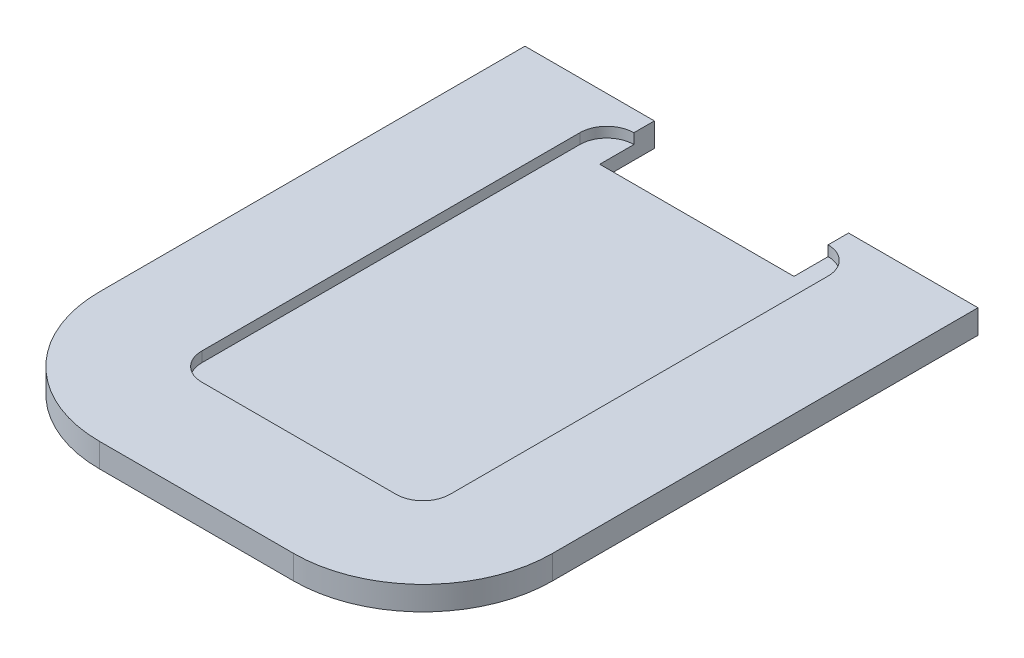
ISO-10303-21;
HEADER;
FILE_DESCRIPTION(('STEP AP214'),'2;1');
FILE_NAME('part.step','',(''),(''),'','','');
FILE_SCHEMA(('AUTOMOTIVE_DESIGN { 1 0 10303 214 1 1 1 1 }'));
ENDSEC;
DATA;
#1=APPLICATION_CONTEXT('core data for automotive mechanical design processes');
#2=APPLICATION_PROTOCOL_DEFINITION('international standard','automotive_design',2000,#1);
#3=PRODUCT_CONTEXT('',#1,'mechanical');
#4=PRODUCT('Part','Part','',(#3));
#5=PRODUCT_RELATED_PRODUCT_CATEGORY('part','',(#4));
#6=PRODUCT_DEFINITION_FORMATION('','',#4);
#7=PRODUCT_DEFINITION_CONTEXT('part definition',#1,'design');
#8=PRODUCT_DEFINITION('design','',#6,#7);
#9=PRODUCT_DEFINITION_SHAPE('','',#8);
#10=(LENGTH_UNIT() NAMED_UNIT(*) SI_UNIT(.MILLI.,.METRE.));
#11=(NAMED_UNIT(*) PLANE_ANGLE_UNIT() SI_UNIT($,.RADIAN.));
#12=(NAMED_UNIT(*) SI_UNIT($,.STERADIAN.) SOLID_ANGLE_UNIT());
#13=UNCERTAINTY_MEASURE_WITH_UNIT(LENGTH_MEASURE(1.E-05),#10,'distance_accuracy_value','');
#14=(GEOMETRIC_REPRESENTATION_CONTEXT(3) GLOBAL_UNCERTAINTY_ASSIGNED_CONTEXT((#13)) GLOBAL_UNIT_ASSIGNED_CONTEXT((#10,
#11,#12)) REPRESENTATION_CONTEXT('',''));
#15=CARTESIAN_POINT('',(0.,0.,0.));
#16=DIRECTION('',(0.,0.,1.));
#17=DIRECTION('',(1.,0.,0.));
#18=AXIS2_PLACEMENT_3D('',#15,#16,#17);
#19=CARTESIAN_POINT('',(14.2680130522602,28.4273462857754,2.97171263536325E-13));
#20=DIRECTION('',(-1.,0.,0.));
#21=DIRECTION('',(0.,0.,1.));
#22=AXIS2_PLACEMENT_3D('',#19,#20,#21);
#23=PLANE('',#22);
#24=DIRECTION('',(0.,0.,1.));
#25=VECTOR('',#24,1.);
#26=CARTESIAN_POINT('',(14.2680130522602,30.4273462857754,3.18120151569384E-13));
#27=LINE('',#26,#25);
#28=CARTESIAN_POINT('',(14.2680130522602,30.4273462857752,15.1963205655378));
#29=VERTEX_POINT('',#28);
#30=CARTESIAN_POINT('',(14.2680130522602,30.4273462857752,20.1963205655378));
#31=VERTEX_POINT('',#30);
#32=EDGE_CURVE('E128',#29,#31,#27,.T.);
#33=ORIENTED_EDGE('',*,*,#32,.T.);
#34=DIRECTION('',(0.,1.,0.));
#35=VECTOR('',#34,1.);
#36=CARTESIAN_POINT('',(14.2680130522602,28.4273462857752,20.1963205655378));
#37=LINE('',#36,#35);
#38=CARTESIAN_POINT('',(14.2680130522602,28.4273462857752,20.1963205655378));
#39=VERTEX_POINT('',#38);
#40=EDGE_CURVE('E11',#39,#31,#37,.T.);
#41=ORIENTED_EDGE('',*,*,#40,.F.);
#42=DIRECTION('',(0.,0.,1.));
#43=VECTOR('',#42,1.);
#44=CARTESIAN_POINT('',(14.2680130522602,28.4273462857754,2.97171263536325E-13));
#45=LINE('',#44,#43);
#46=CARTESIAN_POINT('',(14.2680130522602,28.4273462857753,12.1963205655378));
#47=VERTEX_POINT('',#46);
#48=EDGE_CURVE('E137',#47,#39,#45,.T.);
#49=ORIENTED_EDGE('',*,*,#48,.F.);
#50=DIRECTION('',(0.,-1.,0.));
#51=VECTOR('',#50,1.);
#52=CARTESIAN_POINT('',(14.2680130522602,31.9273462857753,12.1963205655378));
#53=LINE('',#52,#51);
#54=CARTESIAN_POINT('',(14.2680130522602,31.9273462857753,12.1963205655378));
#55=VERTEX_POINT('',#54);
#56=EDGE_CURVE('E168',#55,#47,#53,.T.);
#57=ORIENTED_EDGE('',*,*,#56,.F.);
#58=DIRECTION('',(0.,0.,1.));
#59=VECTOR('',#58,1.);
#60=CARTESIAN_POINT('',(14.2680130522602,31.9273462857753,15.1963205655378));
#61=LINE('',#60,#59);
#62=CARTESIAN_POINT('',(14.2680130522602,31.9273462857753,15.1963205655378));
#63=VERTEX_POINT('',#62);
#64=EDGE_CURVE('E233',#55,#63,#61,.T.);
#65=ORIENTED_EDGE('',*,*,#64,.T.);
#66=DIRECTION('',(0.,-1.,0.));
#67=VECTOR('',#66,1.);
#68=CARTESIAN_POINT('',(14.2680130522602,31.9273462857753,15.1963205655378));
#69=LINE('',#68,#67);
#70=EDGE_CURVE('E162',#63,#29,#69,.T.);
#71=ORIENTED_EDGE('',*,*,#70,.T.);
#72=EDGE_LOOP('',(#33,#41,#49,#57,#65,#71));
#73=FACE_BOUND('',#72,.T.);
#74=ADVANCED_FACE('F37',(#73),#23,.F.);
#75=CARTESIAN_POINT('',(0.,28.4273462857752,20.1963205655378));
#76=DIRECTION('',(0.,0.,1.));
#77=DIRECTION('',(0.,-1.,0.));
#78=AXIS2_PLACEMENT_3D('',#75,#76,#77);
#79=PLANE('',#78);
#80=DIRECTION('',(1.,0.,0.));
#81=VECTOR('',#80,1.);
#82=CARTESIAN_POINT('',(0.,30.4273462857752,20.1963205655378));
#83=LINE('',#82,#81);
#84=CARTESIAN_POINT('',(42.7160130522602,30.4273462857752,20.1963205655378));
#85=VERTEX_POINT('',#84);
#86=EDGE_CURVE('E131',#31,#85,#83,.T.);
#87=ORIENTED_EDGE('',*,*,#86,.T.);
#88=DIRECTION('',(0.,1.,0.));
#89=VECTOR('',#88,1.);
#90=CARTESIAN_POINT('',(42.7160130522602,28.4273462857752,20.1963205655378));
#91=LINE('',#90,#89);
#92=CARTESIAN_POINT('',(42.7160130522602,28.4273462857752,20.1963205655378));
#93=VERTEX_POINT('',#92);
#94=EDGE_CURVE('E44',#93,#85,#91,.T.);
#95=ORIENTED_EDGE('',*,*,#94,.F.);
#96=DIRECTION('',(1.,0.,0.));
#97=VECTOR('',#96,1.);
#98=CARTESIAN_POINT('',(0.,28.4273462857752,20.1963205655378));
#99=LINE('',#98,#97);
#100=EDGE_CURVE('E82',#39,#93,#99,.T.);
#101=ORIENTED_EDGE('',*,*,#100,.F.);
#102=ORIENTED_EDGE('',*,*,#40,.T.);
#103=EDGE_LOOP('',(#87,#95,#101,#102));
#104=FACE_BOUND('',#103,.T.);
#105=ADVANCED_FACE('F359',(#104),#79,.F.);
#106=CARTESIAN_POINT('',(42.7160130522602,28.4273462857754,3.56451640049835E-13));
#107=DIRECTION('',(-1.,0.,0.));
#108=DIRECTION('',(0.,0.,1.));
#109=AXIS2_PLACEMENT_3D('',#106,#107,#108);
#110=PLANE('',#109);
#111=DIRECTION('',(0.,0.,1.));
#112=VECTOR('',#111,1.);
#113=CARTESIAN_POINT('',(42.7160130522602,30.4273462857754,3.77400528082894E-13));
#114=LINE('',#113,#112);
#115=CARTESIAN_POINT('',(42.7160130522602,30.4273462857752,15.1963205655378));
#116=VERTEX_POINT('',#115);
#117=EDGE_CURVE('E134',#116,#85,#114,.T.);
#118=ORIENTED_EDGE('',*,*,#117,.F.);
#119=DIRECTION('',(0.,-1.,0.));
#120=VECTOR('',#119,1.);
#121=CARTESIAN_POINT('',(42.7160130522602,31.9273462857753,15.1963205655378));
#122=LINE('',#121,#120);
#123=CARTESIAN_POINT('',(42.7160130522602,31.9273462857753,15.1963205655378));
#124=VERTEX_POINT('',#123);
#125=EDGE_CURVE('E160',#124,#116,#122,.T.);
#126=ORIENTED_EDGE('',*,*,#125,.F.);
#127=DIRECTION('',(0.,0.,-1.));
#128=VECTOR('',#127,1.);
#129=CARTESIAN_POINT('',(42.7160130522602,31.9273462857753,15.1963205655378));
#130=LINE('',#129,#128);
#131=CARTESIAN_POINT('',(42.7160130522602,31.9273462857753,12.1963205655378));
#132=VERTEX_POINT('',#131);
#133=EDGE_CURVE('E223',#124,#132,#130,.T.);
#134=ORIENTED_EDGE('',*,*,#133,.T.);
#135=DIRECTION('',(0.,-1.,0.));
#136=VECTOR('',#135,1.);
#137=CARTESIAN_POINT('',(42.7160130522602,31.9273462857753,12.1963205655378));
#138=LINE('',#137,#136);
#139=CARTESIAN_POINT('',(42.7160130522602,28.4273462857753,12.1963205655378));
#140=VERTEX_POINT('',#139);
#141=EDGE_CURVE('E219',#132,#140,#138,.T.);
#142=ORIENTED_EDGE('',*,*,#141,.T.);
#143=DIRECTION('',(0.,0.,1.));
#144=VECTOR('',#143,1.);
#145=CARTESIAN_POINT('',(42.7160130522602,28.4273462857754,3.56451640049835E-13));
#146=LINE('',#145,#144);
#147=EDGE_CURVE('E207',#140,#93,#146,.T.);
#148=ORIENTED_EDGE('',*,*,#147,.T.);
#149=ORIENTED_EDGE('',*,*,#94,.T.);
#150=EDGE_LOOP('',(#118,#126,#134,#142,#148,#149));
#151=FACE_BOUND('',#150,.T.);
#152=ADVANCED_FACE('F347',(#151),#110,.T.);
#153=CARTESIAN_POINT('',(61.6760130522602,28.4273462857754,2.97171263536325E-13));
#154=DIRECTION('',(1.,0.,0.));
#155=DIRECTION('',(0.,0.,-1.));
#156=AXIS2_PLACEMENT_3D('',#153,#154,#155);
#157=PLANE('',#156);
#158=DIRECTION('',(0.,0.,-1.));
#159=VECTOR('',#158,1.);
#160=CARTESIAN_POINT('',(61.6760130522602,28.4273462857754,2.97171263536325E-13));
#161=LINE('',#160,#159);
#162=CARTESIAN_POINT('',(61.6760130522602,28.4273462857746,74.5283205655378));
#163=VERTEX_POINT('',#162);
#164=CARTESIAN_POINT('',(61.6760130522602,28.4273462857753,12.1963205655378));
#165=VERTEX_POINT('',#164);
#166=EDGE_CURVE('E102',#163,#165,#161,.T.);
#167=ORIENTED_EDGE('',*,*,#166,.T.);
#168=DIRECTION('',(0.,-1.,0.));
#169=VECTOR('',#168,1.);
#170=CARTESIAN_POINT('',(61.6760130522602,31.9273462857753,12.1963205655378));
#171=LINE('',#170,#169);
#172=CARTESIAN_POINT('',(61.6760130522602,31.9273462857753,12.1963205655378));
#173=VERTEX_POINT('',#172);
#174=EDGE_CURVE('E158',#173,#165,#171,.T.);
#175=ORIENTED_EDGE('',*,*,#174,.F.);
#176=DIRECTION('',(0.,0.,-1.));
#177=VECTOR('',#176,1.);
#178=CARTESIAN_POINT('',(61.6760130522602,31.9273462857754,3.33802762299626E-13));
#179=LINE('',#178,#177);
#180=CARTESIAN_POINT('',(61.6760130522602,31.9273462857746,74.5283205655379));
#181=VERTEX_POINT('',#180);
#182=EDGE_CURVE('E151',#181,#173,#179,.T.);
#183=ORIENTED_EDGE('',*,*,#182,.F.);
#184=DIRECTION('',(0.,1.,0.));
#185=VECTOR('',#184,1.);
#186=CARTESIAN_POINT('',(61.6760130522602,28.4273462857746,74.5283205655378));
#187=LINE('',#186,#185);
#188=EDGE_CURVE('E116',#163,#181,#187,.T.);
#189=ORIENTED_EDGE('',*,*,#188,.F.);
#190=EDGE_LOOP('',(#167,#175,#183,#189));
#191=FACE_BOUND('',#190,.T.);
#192=ADVANCED_FACE('F156',(#191),#157,.T.);
#193=CARTESIAN_POINT('',(42.7160130522602,28.4273462857746,74.5283205655378));
#194=DIRECTION('',(0.,1.,0.));
#195=DIRECTION('',(0.,0.,1.));
#196=AXIS2_PLACEMENT_3D('',#193,#194,#195);
#197=CYLINDRICAL_SURFACE('',#196,18.96);
#198=ORIENTED_EDGE('',*,*,#188,.T.);
#199=CARTESIAN_POINT('',(42.7160130522602,31.9273462857746,74.5283205655379));
#200=DIRECTION('',(0.,1.,0.));
#201=DIRECTION('',(0.,0.,1.));
#202=AXIS2_PLACEMENT_3D('',#199,#200,#201);
#203=CIRCLE('',#202,18.96);
#204=CARTESIAN_POINT('',(42.7160130522602,31.9273462857744,93.4883205655378));
#205=VERTEX_POINT('',#204);
#206=EDGE_CURVE('E112',#205,#181,#203,.T.);
#207=ORIENTED_EDGE('',*,*,#206,.F.);
#208=DIRECTION('',(0.,1.,0.));
#209=VECTOR('',#208,1.);
#210=CARTESIAN_POINT('',(42.7160130522602,28.4273462857744,93.4883205655378));
#211=LINE('',#210,#209);
#212=CARTESIAN_POINT('',(42.7160130522602,28.4273462857744,93.4883205655378));
#213=VERTEX_POINT('',#212);
#214=EDGE_CURVE('E108',#213,#205,#211,.T.);
#215=ORIENTED_EDGE('',*,*,#214,.F.);
#216=CARTESIAN_POINT('',(42.7160130522602,28.4273462857746,74.5283205655378));
#217=DIRECTION('',(0.,-1.,0.));
#218=DIRECTION('',(0.,0.,-1.));
#219=AXIS2_PLACEMENT_3D('',#216,#217,#218);
#220=CIRCLE('',#219,18.96);
#221=EDGE_CURVE('E94',#163,#213,#220,.T.);
#222=ORIENTED_EDGE('',*,*,#221,.F.);
#223=EDGE_LOOP('',(#198,#207,#215,#222));
#224=FACE_BOUND('',#223,.T.);
#225=ADVANCED_FACE('F109',(#224),#197,.T.);
#226=CARTESIAN_POINT('',(0.,28.4273462857744,93.4883205655378));
#227=DIRECTION('',(0.,0.,-1.));
#228=DIRECTION('',(0.,1.,0.));
#229=AXIS2_PLACEMENT_3D('',#226,#227,#228);
#230=PLANE('',#229);
#231=ORIENTED_EDGE('',*,*,#214,.T.);
#232=DIRECTION('',(1.,0.,0.));
#233=VECTOR('',#232,1.);
#234=CARTESIAN_POINT('',(0.,31.9273462857744,93.4883205655378));
#235=LINE('',#234,#233);
#236=CARTESIAN_POINT('',(14.2680130522602,31.9273462857744,93.4883205655378));
#237=VERTEX_POINT('',#236);
#238=EDGE_CURVE('E154',#237,#205,#235,.T.);
#239=ORIENTED_EDGE('',*,*,#238,.F.);
#240=DIRECTION('',(0.,1.,0.));
#241=VECTOR('',#240,1.);
#242=CARTESIAN_POINT('',(14.2680130522602,28.4273462857744,93.4883205655378));
#243=LINE('',#242,#241);
#244=CARTESIAN_POINT('',(14.2680130522602,28.4273462857744,93.4883205655378));
#245=VERTEX_POINT('',#244);
#246=EDGE_CURVE('E117',#245,#237,#243,.T.);
#247=ORIENTED_EDGE('',*,*,#246,.F.);
#248=DIRECTION('',(-1.,0.,0.));
#249=VECTOR('',#248,1.);
#250=CARTESIAN_POINT('',(0.,28.4273462857744,93.4883205655378));
#251=LINE('',#250,#249);
#252=EDGE_CURVE('E98',#213,#245,#251,.T.);
#253=ORIENTED_EDGE('',*,*,#252,.F.);
#254=EDGE_LOOP('',(#231,#239,#247,#253));
#255=FACE_BOUND('',#254,.T.);
#256=ADVANCED_FACE('F119',(#255),#230,.F.);
#257=CARTESIAN_POINT('',(14.2680130522602,28.4273462857746,74.5283205655378));
#258=DIRECTION('',(0.,1.,0.));
#259=DIRECTION('',(0.,0.,1.));
#260=AXIS2_PLACEMENT_3D('',#257,#258,#259);
#261=CYLINDRICAL_SURFACE('',#260,18.96);
#262=ORIENTED_EDGE('',*,*,#246,.T.);
#263=CARTESIAN_POINT('',(14.2680130522602,31.9273462857746,74.5283205655379));
#264=DIRECTION('',(0.,1.,0.));
#265=DIRECTION('',(0.,0.,1.));
#266=AXIS2_PLACEMENT_3D('',#263,#264,#265);
#267=CIRCLE('',#266,18.96);
#268=CARTESIAN_POINT('',(-4.6919869477398,31.9273462857746,74.5283205655379));
#269=VERTEX_POINT('',#268);
#270=EDGE_CURVE('E266',#269,#237,#267,.T.);
#271=ORIENTED_EDGE('',*,*,#270,.F.);
#272=DIRECTION('',(0.,1.,0.));
#273=VECTOR('',#272,1.);
#274=CARTESIAN_POINT('',(-4.6919869477398,28.4273462857746,74.5283205655378));
#275=LINE('',#274,#273);
#276=CARTESIAN_POINT('',(-4.6919869477398,28.4273462857746,74.5283205655378));
#277=VERTEX_POINT('',#276);
#278=EDGE_CURVE('E127',#277,#269,#275,.T.);
#279=ORIENTED_EDGE('',*,*,#278,.F.);
#280=CARTESIAN_POINT('',(14.2680130522602,28.4273462857746,74.5283205655378));
#281=DIRECTION('',(0.,-1.,0.));
#282=DIRECTION('',(0.,0.,-1.));
#283=AXIS2_PLACEMENT_3D('',#280,#281,#282);
#284=CIRCLE('',#283,18.96);
#285=EDGE_CURVE('E60',#245,#277,#284,.T.);
#286=ORIENTED_EDGE('',*,*,#285,.F.);
#287=EDGE_LOOP('',(#262,#271,#279,#286));
#288=FACE_BOUND('',#287,.T.);
#289=ADVANCED_FACE('F274',(#288),#261,.T.);
#290=CARTESIAN_POINT('',(-4.69198694773981,28.4273462857754,2.97465249663148E-13));
#291=DIRECTION('',(1.,0.,0.));
#292=DIRECTION('',(0.,0.,-1.));
#293=AXIS2_PLACEMENT_3D('',#290,#291,#292);
#294=PLANE('',#293);
#295=ORIENTED_EDGE('',*,*,#278,.T.);
#296=DIRECTION('',(0.,0.,1.));
#297=VECTOR('',#296,1.);
#298=CARTESIAN_POINT('',(-4.69198694773981,31.9273462857754,3.34096748426449E-13));
#299=LINE('',#298,#297);
#300=CARTESIAN_POINT('',(-4.69198694773981,31.9273462857753,12.1963205655378));
#301=VERTEX_POINT('',#300);
#302=EDGE_CURVE('E263',#301,#269,#299,.T.);
#303=ORIENTED_EDGE('',*,*,#302,.F.);
#304=DIRECTION('',(0.,-1.,0.));
#305=VECTOR('',#304,1.);
#306=CARTESIAN_POINT('',(-4.69198694773981,31.9273462857753,12.1963205655378));
#307=LINE('',#306,#305);
#308=CARTESIAN_POINT('',(-4.69198694773981,28.4273462857753,12.1963205655378));
#309=VERTEX_POINT('',#308);
#310=EDGE_CURVE('E236',#301,#309,#307,.T.);
#311=ORIENTED_EDGE('',*,*,#310,.T.);
#312=DIRECTION('',(0.,0.,-1.));
#313=VECTOR('',#312,1.);
#314=CARTESIAN_POINT('',(-4.69198694773981,28.4273462857754,2.97465249663148E-13));
#315=LINE('',#314,#313);
#316=EDGE_CURVE('E122',#277,#309,#315,.T.);
#317=ORIENTED_EDGE('',*,*,#316,.F.);
#318=EDGE_LOOP('',(#295,#303,#311,#317));
#319=FACE_BOUND('',#318,.T.);
#320=ADVANCED_FACE('F377',(#319),#294,.F.);
#321=CARTESIAN_POINT('',(0.,28.4273462857754,2.97171263536325E-13));
#322=DIRECTION('',(0.,-1.,0.));
#323=DIRECTION('',(0.,0.,-1.));
#324=AXIS2_PLACEMENT_3D('',#321,#322,#323);
#325=PLANE('',#324);
#326=ORIENTED_EDGE('',*,*,#48,.T.);
#327=ORIENTED_EDGE('',*,*,#100,.T.);
#328=ORIENTED_EDGE('',*,*,#147,.F.);
#329=DIRECTION('',(1.,0.,0.));
#330=VECTOR('',#329,1.);
#331=CARTESIAN_POINT('',(42.7160130522602,28.4273462857753,12.1963205655378));
#332=LINE('',#331,#330);
#333=EDGE_CURVE('E216',#140,#165,#332,.T.);
#334=ORIENTED_EDGE('',*,*,#333,.T.);
#335=ORIENTED_EDGE('',*,*,#166,.F.);
#336=ORIENTED_EDGE('',*,*,#221,.T.);
#337=ORIENTED_EDGE('',*,*,#252,.T.);
#338=ORIENTED_EDGE('',*,*,#285,.T.);
#339=ORIENTED_EDGE('',*,*,#316,.T.);
#340=DIRECTION('',(1.,0.,0.));
#341=VECTOR('',#340,1.);
#342=CARTESIAN_POINT('',(-4.69198694773981,28.4273462857753,12.1963205655378));
#343=LINE('',#342,#341);
#344=EDGE_CURVE('E218',#309,#47,#343,.T.);
#345=ORIENTED_EDGE('',*,*,#344,.T.);
#346=EDGE_LOOP('',(#326,#327,#328,#334,#335,#336,#337,#338,#339,#345));
#347=FACE_BOUND('',#346,.T.);
#348=ADVANCED_FACE('F96',(#347),#325,.T.);
#349=CARTESIAN_POINT('',(0.,30.4273462857754,3.18120151569384E-13));
#350=DIRECTION('',(0.,-1.,0.));
#351=DIRECTION('',(0.,0.,-1.));
#352=AXIS2_PLACEMENT_3D('',#349,#350,#351);
#353=PLANE('',#352);
#354=DIRECTION('',(0.,0.,-1.));
#355=VECTOR('',#354,1.);
#356=CARTESIAN_POINT('',(46.6760130522602,30.4273462857754,3.18120151569384E-13));
#357=LINE('',#356,#355);
#358=CARTESIAN_POINT('',(46.6760130522602,30.4273462857746,74.5283205655378));
#359=VERTEX_POINT('',#358);
#360=CARTESIAN_POINT('',(46.6760130522602,30.4273462857752,19.1563205655378));
#361=VERTEX_POINT('',#360);
#362=EDGE_CURVE('E167',#359,#361,#357,.T.);
#363=ORIENTED_EDGE('',*,*,#362,.T.);
#364=CARTESIAN_POINT('',(42.7160130522602,30.4273462857752,19.1563205655378));
#365=DIRECTION('',(0.,1.,0.));
#366=DIRECTION('',(0.,0.,1.));
#367=AXIS2_PLACEMENT_3D('',#364,#365,#366);
#368=CIRCLE('',#367,3.96);
#369=EDGE_CURVE('E51',#361,#116,#368,.T.);
#370=ORIENTED_EDGE('',*,*,#369,.T.);
#371=ORIENTED_EDGE('',*,*,#117,.T.);
#372=ORIENTED_EDGE('',*,*,#86,.F.);
#373=ORIENTED_EDGE('',*,*,#32,.F.);
#374=CARTESIAN_POINT('',(14.2680130522602,30.4273462857752,19.1563205655378));
#375=DIRECTION('',(0.,1.,0.));
#376=DIRECTION('',(0.,0.,1.));
#377=AXIS2_PLACEMENT_3D('',#374,#375,#376);
#378=CIRCLE('',#377,3.96);
#379=CARTESIAN_POINT('',(10.3080130522602,30.4273462857752,19.1563205655378));
#380=VERTEX_POINT('',#379);
#381=EDGE_CURVE('E183',#29,#380,#378,.T.);
#382=ORIENTED_EDGE('',*,*,#381,.T.);
#383=DIRECTION('',(0.,0.,1.));
#384=VECTOR('',#383,1.);
#385=CARTESIAN_POINT('',(10.3080130522602,30.4273462857754,3.18120151569384E-13));
#386=LINE('',#385,#384);
#387=CARTESIAN_POINT('',(10.3080130522602,30.4273462857746,74.5283205655378));
#388=VERTEX_POINT('',#387);
#389=EDGE_CURVE('E180',#380,#388,#386,.T.);
#390=ORIENTED_EDGE('',*,*,#389,.T.);
#391=CARTESIAN_POINT('',(14.2680130522602,30.4273462857746,74.5283205655378));
#392=DIRECTION('',(0.,1.,0.));
#393=DIRECTION('',(0.,0.,1.));
#394=AXIS2_PLACEMENT_3D('',#391,#392,#393);
#395=CIRCLE('',#394,3.96);
#396=CARTESIAN_POINT('',(14.2680130522602,30.4273462857746,78.4883205655378));
#397=VERTEX_POINT('',#396);
#398=EDGE_CURVE('E177',#388,#397,#395,.T.);
#399=ORIENTED_EDGE('',*,*,#398,.T.);
#400=DIRECTION('',(1.,0.,0.));
#401=VECTOR('',#400,1.);
#402=CARTESIAN_POINT('',(0.,30.4273462857746,78.4883205655378));
#403=LINE('',#402,#401);
#404=CARTESIAN_POINT('',(42.7160130522602,30.4273462857746,78.4883205655378));
#405=VERTEX_POINT('',#404);
#406=EDGE_CURVE('E174',#397,#405,#403,.T.);
#407=ORIENTED_EDGE('',*,*,#406,.T.);
#408=CARTESIAN_POINT('',(42.7160130522602,30.4273462857746,74.5283205655378));
#409=DIRECTION('',(0.,1.,0.));
#410=DIRECTION('',(0.,0.,1.));
#411=AXIS2_PLACEMENT_3D('',#408,#409,#410);
#412=CIRCLE('',#411,3.95999999999999);
#413=EDGE_CURVE('E171',#405,#359,#412,.T.);
#414=ORIENTED_EDGE('',*,*,#413,.T.);
#415=EDGE_LOOP('',(#363,#370,#371,#372,#373,#382,#390,#399,#407,#414));
#416=FACE_BOUND('',#415,.T.);
#417=ADVANCED_FACE('F323',(#416),#353,.F.);
#418=CARTESIAN_POINT('',(42.7160130522602,31.9273462857752,19.1563205655379));
#419=DIRECTION('',(0.,-1.,0.));
#420=DIRECTION('',(0.,0.,-1.));
#421=AXIS2_PLACEMENT_3D('',#418,#419,#420);
#422=CYLINDRICAL_SURFACE('',#421,3.96);
#423=ORIENTED_EDGE('',*,*,#369,.F.);
#424=DIRECTION('',(0.,-1.,0.));
#425=VECTOR('',#424,1.);
#426=CARTESIAN_POINT('',(46.6760130522602,31.9273462857752,19.1563205655379));
#427=LINE('',#426,#425);
#428=CARTESIAN_POINT('',(46.6760130522602,31.9273462857752,19.1563205655379));
#429=VERTEX_POINT('',#428);
#430=EDGE_CURVE('E132',#429,#361,#427,.T.);
#431=ORIENTED_EDGE('',*,*,#430,.F.);
#432=CARTESIAN_POINT('',(42.7160130522602,31.9273462857752,19.1563205655379));
#433=DIRECTION('',(0.,1.,0.));
#434=DIRECTION('',(0.,0.,1.));
#435=AXIS2_PLACEMENT_3D('',#432,#433,#434);
#436=CIRCLE('',#435,3.96);
#437=EDGE_CURVE('E185',#429,#124,#436,.T.);
#438=ORIENTED_EDGE('',*,*,#437,.T.);
#439=ORIENTED_EDGE('',*,*,#125,.T.);
#440=EDGE_LOOP('',(#423,#431,#438,#439));
#441=FACE_BOUND('',#440,.T.);
#442=ADVANCED_FACE('F348',(#441),#422,.F.);
#443=CARTESIAN_POINT('',(46.6760130522602,31.9273462857754,3.33802762299626E-13));
#444=DIRECTION('',(-1.,0.,0.));
#445=DIRECTION('',(0.,0.,1.));
#446=AXIS2_PLACEMENT_3D('',#443,#444,#445);
#447=PLANE('',#446);
#448=ORIENTED_EDGE('',*,*,#362,.F.);
#449=DIRECTION('',(0.,-1.,0.));
#450=VECTOR('',#449,1.);
#451=CARTESIAN_POINT('',(46.6760130522602,31.9273462857746,74.5283205655379));
#452=LINE('',#451,#450);
#453=CARTESIAN_POINT('',(46.6760130522602,31.9273462857746,74.5283205655379));
#454=VERTEX_POINT('',#453);
#455=EDGE_CURVE('E201',#454,#359,#452,.T.);
#456=ORIENTED_EDGE('',*,*,#455,.F.);
#457=DIRECTION('',(0.,0.,-1.));
#458=VECTOR('',#457,1.);
#459=CARTESIAN_POINT('',(46.6760130522602,31.9273462857754,3.33802762299626E-13));
#460=LINE('',#459,#458);
#461=EDGE_CURVE('E245',#454,#429,#460,.T.);
#462=ORIENTED_EDGE('',*,*,#461,.T.);
#463=ORIENTED_EDGE('',*,*,#430,.T.);
#464=EDGE_LOOP('',(#448,#456,#462,#463));
#465=FACE_BOUND('',#464,.T.);
#466=ADVANCED_FACE('F352',(#465),#447,.T.);
#467=CARTESIAN_POINT('',(42.7160130522602,31.9273462857746,74.5283205655379));
#468=DIRECTION('',(0.,-1.,0.));
#469=DIRECTION('',(0.,0.,-1.));
#470=AXIS2_PLACEMENT_3D('',#467,#468,#469);
#471=CYLINDRICAL_SURFACE('',#470,3.95999999999999);
#472=ORIENTED_EDGE('',*,*,#413,.F.);
#473=DIRECTION('',(0.,-1.,0.));
#474=VECTOR('',#473,1.);
#475=CARTESIAN_POINT('',(42.7160130522602,31.9273462857746,78.4883205655378));
#476=LINE('',#475,#474);
#477=CARTESIAN_POINT('',(42.7160130522602,31.9273462857746,78.4883205655378));
#478=VERTEX_POINT('',#477);
#479=EDGE_CURVE('E198',#478,#405,#476,.T.);
#480=ORIENTED_EDGE('',*,*,#479,.F.);
#481=CARTESIAN_POINT('',(42.7160130522602,31.9273462857746,74.5283205655379));
#482=DIRECTION('',(0.,1.,0.));
#483=DIRECTION('',(0.,0.,1.));
#484=AXIS2_PLACEMENT_3D('',#481,#482,#483);
#485=CIRCLE('',#484,3.95999999999999);
#486=EDGE_CURVE('E248',#478,#454,#485,.T.);
#487=ORIENTED_EDGE('',*,*,#486,.T.);
#488=ORIENTED_EDGE('',*,*,#455,.T.);
#489=EDGE_LOOP('',(#472,#480,#487,#488));
#490=FACE_BOUND('',#489,.T.);
#491=ADVANCED_FACE('F355',(#490),#471,.F.);
#492=CARTESIAN_POINT('',(0.,31.9273462857746,78.4883205655378));
#493=DIRECTION('',(0.,0.,-1.));
#494=DIRECTION('',(0.,1.,0.));
#495=AXIS2_PLACEMENT_3D('',#492,#493,#494);
#496=PLANE('',#495);
#497=ORIENTED_EDGE('',*,*,#406,.F.);
#498=DIRECTION('',(0.,-1.,0.));
#499=VECTOR('',#498,1.);
#500=CARTESIAN_POINT('',(14.2680130522602,31.9273462857746,78.4883205655378));
#501=LINE('',#500,#499);
#502=CARTESIAN_POINT('',(14.2680130522602,31.9273462857746,78.4883205655378));
#503=VERTEX_POINT('',#502);
#504=EDGE_CURVE('E195',#503,#397,#501,.T.);
#505=ORIENTED_EDGE('',*,*,#504,.F.);
#506=DIRECTION('',(1.,0.,0.));
#507=VECTOR('',#506,1.);
#508=CARTESIAN_POINT('',(0.,31.9273462857746,78.4883205655378));
#509=LINE('',#508,#507);
#510=EDGE_CURVE('E251',#503,#478,#509,.T.);
#511=ORIENTED_EDGE('',*,*,#510,.T.);
#512=ORIENTED_EDGE('',*,*,#479,.T.);
#513=EDGE_LOOP('',(#497,#505,#511,#512));
#514=FACE_BOUND('',#513,.T.);
#515=ADVANCED_FACE('F358',(#514),#496,.T.);
#516=CARTESIAN_POINT('',(14.2680130522602,31.9273462857746,74.5283205655379));
#517=DIRECTION('',(0.,-1.,0.));
#518=DIRECTION('',(0.,0.,-1.));
#519=AXIS2_PLACEMENT_3D('',#516,#517,#518);
#520=CYLINDRICAL_SURFACE('',#519,3.96);
#521=ORIENTED_EDGE('',*,*,#398,.F.);
#522=DIRECTION('',(0.,-1.,0.));
#523=VECTOR('',#522,1.);
#524=CARTESIAN_POINT('',(10.3080130522602,31.9273462857746,74.5283205655379));
#525=LINE('',#524,#523);
#526=CARTESIAN_POINT('',(10.3080130522602,31.9273462857746,74.5283205655379));
#527=VERTEX_POINT('',#526);
#528=EDGE_CURVE('E192',#527,#388,#525,.T.);
#529=ORIENTED_EDGE('',*,*,#528,.F.);
#530=CARTESIAN_POINT('',(14.2680130522602,31.9273462857746,74.5283205655379));
#531=DIRECTION('',(0.,1.,0.));
#532=DIRECTION('',(0.,0.,1.));
#533=AXIS2_PLACEMENT_3D('',#530,#531,#532);
#534=CIRCLE('',#533,3.96);
#535=EDGE_CURVE('E254',#527,#503,#534,.T.);
#536=ORIENTED_EDGE('',*,*,#535,.T.);
#537=ORIENTED_EDGE('',*,*,#504,.T.);
#538=EDGE_LOOP('',(#521,#529,#536,#537));
#539=FACE_BOUND('',#538,.T.);
#540=ADVANCED_FACE('F315',(#539),#520,.F.);
#541=CARTESIAN_POINT('',(10.3080130522602,31.9273462857754,3.33802762299626E-13));
#542=DIRECTION('',(1.,0.,0.));
#543=DIRECTION('',(0.,0.,-1.));
#544=AXIS2_PLACEMENT_3D('',#541,#542,#543);
#545=PLANE('',#544);
#546=ORIENTED_EDGE('',*,*,#389,.F.);
#547=DIRECTION('',(0.,-1.,0.));
#548=VECTOR('',#547,1.);
#549=CARTESIAN_POINT('',(10.3080130522602,31.9273462857752,19.1563205655379));
#550=LINE('',#549,#548);
#551=CARTESIAN_POINT('',(10.3080130522602,31.9273462857752,19.1563205655379));
#552=VERTEX_POINT('',#551);
#553=EDGE_CURVE('E189',#552,#380,#550,.T.);
#554=ORIENTED_EDGE('',*,*,#553,.F.);
#555=DIRECTION('',(0.,0.,1.));
#556=VECTOR('',#555,1.);
#557=CARTESIAN_POINT('',(10.3080130522602,31.9273462857754,3.33802762299626E-13));
#558=LINE('',#557,#556);
#559=EDGE_CURVE('E257',#552,#527,#558,.T.);
#560=ORIENTED_EDGE('',*,*,#559,.T.);
#561=ORIENTED_EDGE('',*,*,#528,.T.);
#562=EDGE_LOOP('',(#546,#554,#560,#561));
#563=FACE_BOUND('',#562,.T.);
#564=ADVANCED_FACE('F320',(#563),#545,.T.);
#565=CARTESIAN_POINT('',(14.2680130522602,31.9273462857752,19.1563205655379));
#566=DIRECTION('',(0.,-1.,0.));
#567=DIRECTION('',(0.,0.,-1.));
#568=AXIS2_PLACEMENT_3D('',#565,#566,#567);
#569=CYLINDRICAL_SURFACE('',#568,3.96);
#570=ORIENTED_EDGE('',*,*,#381,.F.);
#571=ORIENTED_EDGE('',*,*,#70,.F.);
#572=CARTESIAN_POINT('',(14.2680130522602,31.9273462857752,19.1563205655379));
#573=DIRECTION('',(0.,1.,0.));
#574=DIRECTION('',(0.,0.,1.));
#575=AXIS2_PLACEMENT_3D('',#572,#573,#574);
#576=CIRCLE('',#575,3.96);
#577=EDGE_CURVE('E260',#63,#552,#576,.T.);
#578=ORIENTED_EDGE('',*,*,#577,.T.);
#579=ORIENTED_EDGE('',*,*,#553,.T.);
#580=EDGE_LOOP('',(#570,#571,#578,#579));
#581=FACE_BOUND('',#580,.T.);
#582=ADVANCED_FACE('F325',(#581),#569,.F.);
#583=CARTESIAN_POINT('',(0.,31.9273462857754,3.33802762299626E-13));
#584=DIRECTION('',(0.,1.,0.));
#585=DIRECTION('',(0.,0.,1.));
#586=AXIS2_PLACEMENT_3D('',#583,#584,#585);
#587=PLANE('',#586);
#588=ORIENTED_EDGE('',*,*,#437,.F.);
#589=ORIENTED_EDGE('',*,*,#461,.F.);
#590=ORIENTED_EDGE('',*,*,#486,.F.);
#591=ORIENTED_EDGE('',*,*,#510,.F.);
#592=ORIENTED_EDGE('',*,*,#535,.F.);
#593=ORIENTED_EDGE('',*,*,#559,.F.);
#594=ORIENTED_EDGE('',*,*,#577,.F.);
#595=ORIENTED_EDGE('',*,*,#64,.F.);
#596=DIRECTION('',(1.,0.,0.));
#597=VECTOR('',#596,1.);
#598=CARTESIAN_POINT('',(-4.69198694773981,31.9273462857753,12.1963205655378));
#599=LINE('',#598,#597);
#600=EDGE_CURVE('E230',#301,#55,#599,.T.);
#601=ORIENTED_EDGE('',*,*,#600,.F.);
#602=ORIENTED_EDGE('',*,*,#302,.T.);
#603=ORIENTED_EDGE('',*,*,#270,.T.);
#604=ORIENTED_EDGE('',*,*,#238,.T.);
#605=ORIENTED_EDGE('',*,*,#206,.T.);
#606=ORIENTED_EDGE('',*,*,#182,.T.);
#607=DIRECTION('',(1.,0.,0.));
#608=VECTOR('',#607,1.);
#609=CARTESIAN_POINT('',(42.7160130522602,31.9273462857753,12.1963205655378));
#610=LINE('',#609,#608);
#611=EDGE_CURVE('E217',#132,#173,#610,.T.);
#612=ORIENTED_EDGE('',*,*,#611,.F.);
#613=ORIENTED_EDGE('',*,*,#133,.F.);
#614=EDGE_LOOP('',(#588,#589,#590,#591,#592,#593,#594,#595,#601,#602,#603,#604,#605,#606,#612,#613));
#615=FACE_BOUND('',#614,.T.);
#616=ADVANCED_FACE('F148',(#615),#587,.T.);
#617=CARTESIAN_POINT('',(-4.69198694773981,31.9273462857753,12.1963205655378));
#618=DIRECTION('',(0.,0.,-1.));
#619=DIRECTION('',(0.,1.,0.));
#620=AXIS2_PLACEMENT_3D('',#617,#618,#619);
#621=PLANE('',#620);
#622=ORIENTED_EDGE('',*,*,#344,.F.);
#623=ORIENTED_EDGE('',*,*,#310,.F.);
#624=ORIENTED_EDGE('',*,*,#600,.T.);
#625=ORIENTED_EDGE('',*,*,#56,.T.);
#626=EDGE_LOOP('',(#622,#623,#624,#625));
#627=FACE_BOUND('',#626,.T.);
#628=ADVANCED_FACE('F400',(#627),#621,.T.);
#629=CARTESIAN_POINT('',(42.7160130522602,31.9273462857753,12.1963205655378));
#630=DIRECTION('',(0.,0.,-1.));
#631=DIRECTION('',(0.,1.,0.));
#632=AXIS2_PLACEMENT_3D('',#629,#630,#631);
#633=PLANE('',#632);
#634=ORIENTED_EDGE('',*,*,#333,.F.);
#635=ORIENTED_EDGE('',*,*,#141,.F.);
#636=ORIENTED_EDGE('',*,*,#611,.T.);
#637=ORIENTED_EDGE('',*,*,#174,.T.);
#638=EDGE_LOOP('',(#634,#635,#636,#637));
#639=FACE_BOUND('',#638,.T.);
#640=ADVANCED_FACE('F214',(#639),#633,.T.);
#641=CLOSED_SHELL('',(#74,#105,#152,#192,#225,#256,#289,#320,#348,#417,#442,#466,#491,#515,#540,
#564,#582,#616,#628,#640));
#642=MANIFOLD_SOLID_BREP('B2',#641);
#643=ADVANCED_BREP_SHAPE_REPRESENTATION('',(#18,#642),#14);
#644=SHAPE_DEFINITION_REPRESENTATION(#9,#643);
ENDSEC;
END-ISO-10303-21;
